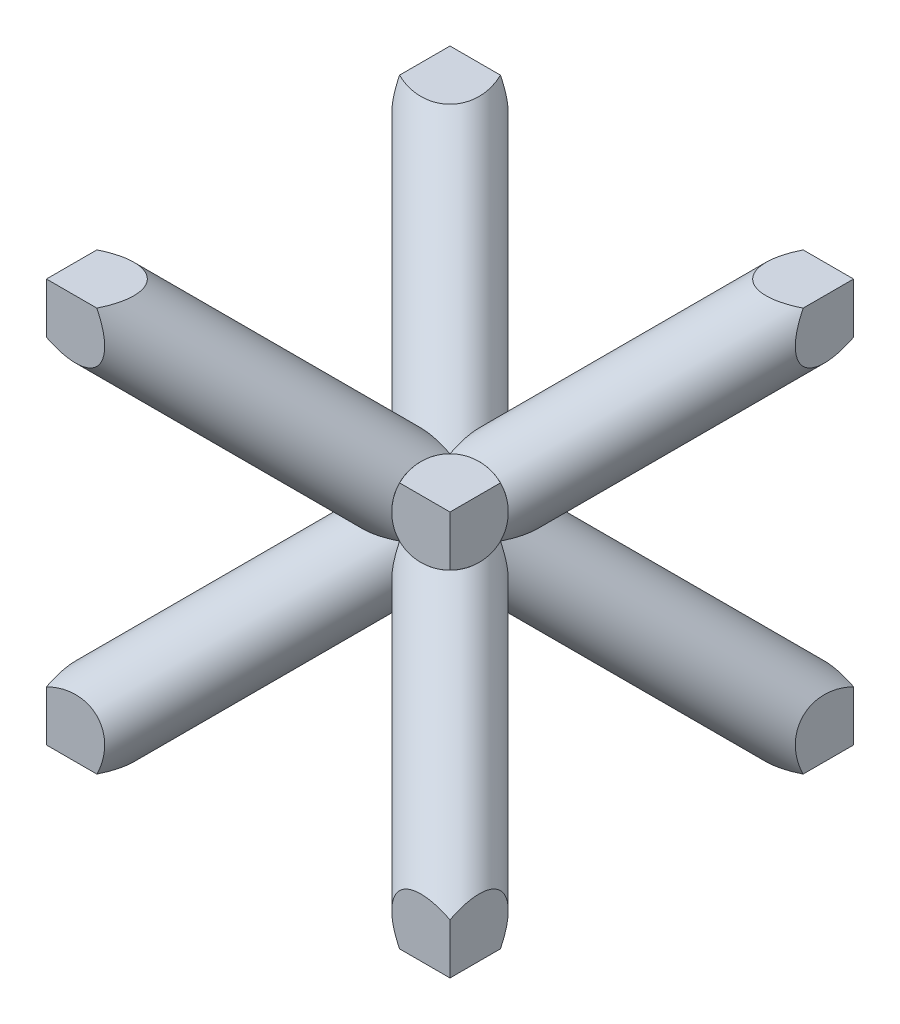
ISO-10303-21;
HEADER;
FILE_DESCRIPTION(('STEP AP214'),'2;1');
FILE_NAME('part.step','',(''),(''),'','','');
FILE_SCHEMA(('AUTOMOTIVE_DESIGN { 1 0 10303 214 1 1 1 1 }'));
ENDSEC;
DATA;
#1=APPLICATION_CONTEXT('core data for automotive mechanical design processes');
#2=APPLICATION_PROTOCOL_DEFINITION('international standard','automotive_design',2000,#1);
#3=PRODUCT_CONTEXT('',#1,'mechanical');
#4=PRODUCT('Part','Part','',(#3));
#5=PRODUCT_RELATED_PRODUCT_CATEGORY('part','',(#4));
#6=PRODUCT_DEFINITION_FORMATION('','',#4);
#7=PRODUCT_DEFINITION_CONTEXT('part definition',#1,'design');
#8=PRODUCT_DEFINITION('design','',#6,#7);
#9=PRODUCT_DEFINITION_SHAPE('','',#8);
#10=(LENGTH_UNIT() NAMED_UNIT(*) SI_UNIT(.MILLI.,.METRE.));
#11=(NAMED_UNIT(*) PLANE_ANGLE_UNIT() SI_UNIT($,.RADIAN.));
#12=(NAMED_UNIT(*) SI_UNIT($,.STERADIAN.) SOLID_ANGLE_UNIT());
#13=UNCERTAINTY_MEASURE_WITH_UNIT(LENGTH_MEASURE(1.E-05),#10,'distance_accuracy_value','');
#14=(GEOMETRIC_REPRESENTATION_CONTEXT(3) GLOBAL_UNCERTAINTY_ASSIGNED_CONTEXT((#13)) GLOBAL_UNIT_ASSIGNED_CONTEXT((#10,
#11,#12)) REPRESENTATION_CONTEXT('',''));
#15=CARTESIAN_POINT('',(0.,0.,0.));
#16=DIRECTION('',(0.,0.,1.));
#17=DIRECTION('',(1.,0.,0.));
#18=AXIS2_PLACEMENT_3D('',#15,#16,#17);
#19=CARTESIAN_POINT('',(4.35578821797053,0.644211782029457,-4.35578821797053));
#20=DIRECTION('',(-0.577350269189626,0.577350269189626,0.577350269189626));
#21=DIRECTION('',(-0.707106781186548,-0.707106781186547,0.));
#22=AXIS2_PLACEMENT_3D('',#19,#20,#21);
#23=CYLINDRICAL_SURFACE('',#22,0.816496580927726);
#24=CARTESIAN_POINT('',(0.,5.00000000000001,0.));
#25=DIRECTION('',(0.,1.,0.));
#26=DIRECTION('',(-0.707106781186548,0.,0.707106781186547));
#27=AXIS2_PLACEMENT_3D('',#24,#25,#26);
#28=ELLIPSE('',#27,1.41421356237308,0.816496580927718);
#29=CARTESIAN_POINT('',(0.999999999999989,4.99999999999999,0.));
#30=VERTEX_POINT('',#29);
#31=CARTESIAN_POINT('',(0.,5.,-1.));
#32=VERTEX_POINT('',#31);
#33=EDGE_CURVE('E548',#30,#32,#28,.T.);
#34=ORIENTED_EDGE('',*,*,#33,.F.);
#35=CARTESIAN_POINT('',(0.,5.,0.));
#36=DIRECTION('',(0.,0.,1.));
#37=DIRECTION('',(-0.707106781186547,0.707106781186548,0.));
#38=AXIS2_PLACEMENT_3D('',#35,#36,#37);
#39=ELLIPSE('',#38,1.4142135623731,0.816496580927727);
#40=CARTESIAN_POINT('',(0.,4.,0.));
#41=VERTEX_POINT('',#40);
#42=EDGE_CURVE('E530',#30,#41,#39,.F.);
#43=ORIENTED_EDGE('',*,*,#42,.T.);
#44=CARTESIAN_POINT('',(0.,5.,0.));
#45=DIRECTION('',(-1.,0.,0.));
#46=DIRECTION('',(0.,0.707106781186548,0.707106781186547));
#47=AXIS2_PLACEMENT_3D('',#44,#45,#46);
#48=ELLIPSE('',#47,1.4142135623731,0.816496580927727);
#49=EDGE_CURVE('E520',#41,#32,#48,.F.);
#50=ORIENTED_EDGE('',*,*,#49,.T.);
#51=EDGE_LOOP('',(#34,#43,#50));
#52=FACE_BOUND('',#51,.T.);
#53=CARTESIAN_POINT('',(3.99999999999999,0.999999999999998,-3.99999999999999));
#54=DIRECTION('',(0.,0.,-1.));
#55=DIRECTION('',(-0.707106781186547,0.707106781186548,0.));
#56=AXIS2_PLACEMENT_3D('',#53,#54,#55);
#57=ELLIPSE('',#56,1.41421356237309,0.816496580927726);
#58=CARTESIAN_POINT('',(3.99999999999999,1.99999999999999,-3.99999999999999));
#59=VERTEX_POINT('',#58);
#60=CARTESIAN_POINT('',(2.99999999999999,1.,-3.99999999999999));
#61=VERTEX_POINT('',#60);
#62=EDGE_CURVE('E260',#59,#61,#57,.F.);
#63=ORIENTED_EDGE('',*,*,#62,.T.);
#64=CARTESIAN_POINT('',(3.99999999999999,1.,-3.99999999999999));
#65=DIRECTION('',(0.,-1.,0.));
#66=DIRECTION('',(-0.707106781186548,0.,0.707106781186547));
#67=AXIS2_PLACEMENT_3D('',#64,#65,#66);
#68=ELLIPSE('',#67,1.41421356237309,0.816496580927726);
#69=CARTESIAN_POINT('',(3.99999999999999,1.,-2.99999999999999));
#70=VERTEX_POINT('',#69);
#71=EDGE_CURVE('E269',#70,#61,#68,.T.);
#72=ORIENTED_EDGE('',*,*,#71,.F.);
#73=CARTESIAN_POINT('',(4.,0.99999999999999,-4.));
#74=DIRECTION('',(1.,0.,0.));
#75=DIRECTION('',(0.,0.707106781186548,0.707106781186547));
#76=AXIS2_PLACEMENT_3D('',#73,#74,#75);
#77=ELLIPSE('',#76,1.4142135623731,0.816496580927726);
#78=EDGE_CURVE('E273',#59,#70,#77,.T.);
#79=ORIENTED_EDGE('',*,*,#78,.F.);
#80=EDGE_LOOP('',(#63,#72,#79));
#81=FACE_BOUND('',#80,.T.);
#82=ADVANCED_FACE('F120',(#52,#81),#23,.T.);
#83=CARTESIAN_POINT('',(-4.32692070451106,0.673079295488972,4.32692070451106));
#84=DIRECTION('',(0.577350269189626,0.577350269189625,-0.577350269189626));
#85=DIRECTION('',(-0.707106781186547,0.,-0.707106781186547));
#86=AXIS2_PLACEMENT_3D('',#83,#84,#85);
#87=CYLINDRICAL_SURFACE('',#86,0.816496580927711);
#88=CARTESIAN_POINT('',(0.,5.00000000000002,0.));
#89=DIRECTION('',(0.,0.,-1.));
#90=DIRECTION('',(-0.707106781186548,-0.707106781186547,0.));
#91=AXIS2_PLACEMENT_3D('',#88,#89,#90);
#92=ELLIPSE('',#91,1.41421356237308,0.816496580927719);
#93=CARTESIAN_POINT('',(0.,6.,0.));
#94=VERTEX_POINT('',#93);
#95=EDGE_CURVE('E309',#30,#94,#92,.F.);
#96=ORIENTED_EDGE('',*,*,#95,.F.);
#97=ORIENTED_EDGE('',*,*,#33,.T.);
#98=CARTESIAN_POINT('',(0.,5.00000000000001,0.));
#99=DIRECTION('',(1.,0.,0.));
#100=DIRECTION('',(0.,-0.707106781186547,0.707106781186548));
#101=AXIS2_PLACEMENT_3D('',#98,#99,#100);
#102=ELLIPSE('',#101,1.41421356237308,0.816496580927719);
#103=EDGE_CURVE('E347',#94,#32,#102,.F.);
#104=ORIENTED_EDGE('',*,*,#103,.F.);
#105=EDGE_LOOP('',(#96,#97,#104));
#106=FACE_BOUND('',#105,.T.);
#107=CARTESIAN_POINT('',(3.99999999999998,9.,-3.99999999999998));
#108=DIRECTION('',(0.,1.,0.));
#109=DIRECTION('',(0.707106781186548,0.,-0.707106781186548));
#110=AXIS2_PLACEMENT_3D('',#107,#108,#109);
#111=ELLIPSE('',#110,1.41421356237307,0.816496580927711);
#112=CARTESIAN_POINT('',(3.00000000000001,9.,-4.));
#113=VERTEX_POINT('',#112);
#114=CARTESIAN_POINT('',(3.99999999999999,8.99999999999999,-3.00000000000001));
#115=VERTEX_POINT('',#114);
#116=EDGE_CURVE('E119',#113,#115,#111,.T.);
#117=ORIENTED_EDGE('',*,*,#116,.F.);
#118=CARTESIAN_POINT('',(4.,9.00000000000002,-4.));
#119=DIRECTION('',(0.,0.,-1.));
#120=DIRECTION('',(0.707106781186548,0.707106781186548,0.));
#121=AXIS2_PLACEMENT_3D('',#118,#119,#120);
#122=ELLIPSE('',#121,1.41421356237307,0.816496580927711);
#123=CARTESIAN_POINT('',(3.99999999999999,8.00000000000004,-4.));
#124=VERTEX_POINT('',#123);
#125=EDGE_CURVE('E144',#113,#124,#122,.F.);
#126=ORIENTED_EDGE('',*,*,#125,.T.);
#127=CARTESIAN_POINT('',(4.,9.00000000000002,-4.));
#128=DIRECTION('',(1.,0.,0.));
#129=DIRECTION('',(0.,0.707106781186547,-0.707106781186548));
#130=AXIS2_PLACEMENT_3D('',#127,#128,#129);
#131=ELLIPSE('',#130,1.41421356237307,0.816496580927711);
#132=EDGE_CURVE('E507',#115,#124,#131,.T.);
#133=ORIENTED_EDGE('',*,*,#132,.F.);
#134=EDGE_LOOP('',(#117,#126,#133));
#135=FACE_BOUND('',#134,.T.);
#136=ADVANCED_FACE('F469',(#106,#135),#87,.T.);
#137=CARTESIAN_POINT('',(-5.00010307764064,9.,0.));
#138=DIRECTION('',(0.,-1.,0.));
#139=DIRECTION('',(0.,0.,-1.));
#140=AXIS2_PLACEMENT_3D('',#137,#138,#139);
#141=PLANE('',#140);
#142=DIRECTION('',(1.,0.,0.));
#143=VECTOR('',#142,1.);
#144=CARTESIAN_POINT('',(2.84529946162075,9.,-4.));
#145=LINE('',#144,#143);
#146=CARTESIAN_POINT('',(3.99999999999999,9.,-4.));
#147=VERTEX_POINT('',#146);
#148=EDGE_CURVE('E275',#113,#147,#145,.T.);
#149=ORIENTED_EDGE('',*,*,#148,.F.);
#150=ORIENTED_EDGE('',*,*,#116,.T.);
#151=DIRECTION('',(0.,0.,1.));
#152=VECTOR('',#151,1.);
#153=CARTESIAN_POINT('',(3.99999999999999,8.99999999999999,-5.02196380801708));
#154=LINE('',#153,#152);
#155=EDGE_CURVE('E318',#147,#115,#154,.T.);
#156=ORIENTED_EDGE('',*,*,#155,.F.);
#157=EDGE_LOOP('',(#149,#150,#156));
#158=FACE_BOUND('',#157,.T.);
#159=ADVANCED_FACE('F464',(#158),#141,.F.);
#160=CARTESIAN_POINT('',(-5.00010307764064,1.,0.));
#161=DIRECTION('',(0.,1.,0.));
#162=DIRECTION('',(0.,0.,1.));
#163=AXIS2_PLACEMENT_3D('',#160,#161,#162);
#164=PLANE('',#163);
#165=DIRECTION('',(-1.,0.,0.));
#166=VECTOR('',#165,1.);
#167=CARTESIAN_POINT('',(-3.99999999999999,0.999999999999996,-4.));
#168=LINE('',#167,#166);
#169=CARTESIAN_POINT('',(-3.,0.999999999999996,-4.));
#170=VERTEX_POINT('',#169);
#171=CARTESIAN_POINT('',(-3.99999999999999,0.999999999999996,-4.));
#172=VERTEX_POINT('',#171);
#173=EDGE_CURVE('E395',#170,#172,#168,.T.);
#174=ORIENTED_EDGE('',*,*,#173,.F.);
#175=CARTESIAN_POINT('',(-4.00000000000001,0.999999999999999,-4.00000000000001));
#176=DIRECTION('',(0.,1.,0.));
#177=DIRECTION('',(-0.707106781186548,0.,-0.707106781186548));
#178=AXIS2_PLACEMENT_3D('',#175,#176,#177);
#179=ELLIPSE('',#178,1.4142135623731,0.816496580927728);
#180=CARTESIAN_POINT('',(-4.,1.,-3.));
#181=VERTEX_POINT('',#180);
#182=EDGE_CURVE('E292',#170,#181,#179,.F.);
#183=ORIENTED_EDGE('',*,*,#182,.T.);
#184=DIRECTION('',(0.,0.,1.));
#185=VECTOR('',#184,1.);
#186=CARTESIAN_POINT('',(-4.,1.,-5.02196380801708));
#187=LINE('',#186,#185);
#188=EDGE_CURVE('E324',#172,#181,#187,.T.);
#189=ORIENTED_EDGE('',*,*,#188,.F.);
#190=EDGE_LOOP('',(#174,#183,#189));
#191=FACE_BOUND('',#190,.T.);
#192=ADVANCED_FACE('F569',(#191),#164,.F.);
#193=DIRECTION('',(-1.,0.,0.));
#194=VECTOR('',#193,1.);
#195=CARTESIAN_POINT('',(3.99999999999999,1.,-3.99999999999999));
#196=LINE('',#195,#194);
#197=CARTESIAN_POINT('',(3.99999999999999,1.,-3.99999999999999));
#198=VERTEX_POINT('',#197);
#199=EDGE_CURVE('E257',#198,#61,#196,.T.);
#200=ORIENTED_EDGE('',*,*,#199,.F.);
#201=DIRECTION('',(0.,0.,1.));
#202=VECTOR('',#201,1.);
#203=CARTESIAN_POINT('',(3.99999999999999,1.,-5.02196380801708));
#204=LINE('',#203,#202);
#205=EDGE_CURVE('E267',#198,#70,#204,.T.);
#206=ORIENTED_EDGE('',*,*,#205,.T.);
#207=ORIENTED_EDGE('',*,*,#71,.T.);
#208=EDGE_LOOP('',(#200,#206,#207));
#209=FACE_BOUND('',#208,.T.);
#210=ADVANCED_FACE('F270',(#209),#164,.F.);
#211=DIRECTION('',(1.,0.,0.));
#212=VECTOR('',#211,1.);
#213=CARTESIAN_POINT('',(-2.84529946162076,9.,-4.00000000000001));
#214=LINE('',#213,#212);
#215=CARTESIAN_POINT('',(-4.,8.99999999999999,-4.00000000000001));
#216=VERTEX_POINT('',#215);
#217=CARTESIAN_POINT('',(-3.,9.,-4.00000000000001));
#218=VERTEX_POINT('',#217);
#219=EDGE_CURVE('E388',#216,#218,#214,.T.);
#220=ORIENTED_EDGE('',*,*,#219,.F.);
#221=DIRECTION('',(0.,0.,1.));
#222=VECTOR('',#221,1.);
#223=CARTESIAN_POINT('',(-4.,9.,-5.02196380801708));
#224=LINE('',#223,#222);
#225=CARTESIAN_POINT('',(-4.,9.,-3.));
#226=VERTEX_POINT('',#225);
#227=EDGE_CURVE('E307',#216,#226,#224,.T.);
#228=ORIENTED_EDGE('',*,*,#227,.T.);
#229=CARTESIAN_POINT('',(-4.,9.,-4.));
#230=DIRECTION('',(0.,-1.,0.));
#231=DIRECTION('',(0.707106781186548,0.,0.707106781186548));
#232=AXIS2_PLACEMENT_3D('',#229,#230,#231);
#233=ELLIPSE('',#232,1.4142135623731,0.816496580927728);
#234=EDGE_CURVE('E366',#226,#218,#233,.F.);
#235=ORIENTED_EDGE('',*,*,#234,.T.);
#236=EDGE_LOOP('',(#220,#228,#235));
#237=FACE_BOUND('',#236,.T.);
#238=ADVANCED_FACE('F394',(#237),#141,.F.);
#239=CARTESIAN_POINT('',(3.99999999999999,1.,-5.02196380801708));
#240=DIRECTION('',(-1.,0.,0.));
#241=DIRECTION('',(0.,0.,1.));
#242=AXIS2_PLACEMENT_3D('',#239,#240,#241);
#243=PLANE('',#242);
#244=DIRECTION('',(0.,-1.,0.));
#245=VECTOR('',#244,1.);
#246=CARTESIAN_POINT('',(3.99999999999999,9.,-4.));
#247=LINE('',#246,#245);
#248=EDGE_CURVE('E254',#59,#198,#247,.T.);
#249=ORIENTED_EDGE('',*,*,#248,.F.);
#250=ORIENTED_EDGE('',*,*,#78,.T.);
#251=ORIENTED_EDGE('',*,*,#205,.F.);
#252=EDGE_LOOP('',(#249,#250,#251));
#253=FACE_BOUND('',#252,.T.);
#254=ADVANCED_FACE('F274',(#253),#243,.F.);
#255=CARTESIAN_POINT('',(-4.,9.,-5.02196380801708));
#256=DIRECTION('',(1.,0.,0.));
#257=DIRECTION('',(0.,1.,0.));
#258=AXIS2_PLACEMENT_3D('',#255,#256,#257);
#259=PLANE('',#258);
#260=DIRECTION('',(0.,1.,0.));
#261=VECTOR('',#260,1.);
#262=CARTESIAN_POINT('',(-4.,8.99999999999999,-4.00000000000001));
#263=LINE('',#262,#261);
#264=CARTESIAN_POINT('',(-4.,2.00000000000001,-4.));
#265=VERTEX_POINT('',#264);
#266=EDGE_CURVE('E126',#172,#265,#263,.T.);
#267=ORIENTED_EDGE('',*,*,#266,.F.);
#268=ORIENTED_EDGE('',*,*,#188,.T.);
#269=CARTESIAN_POINT('',(-4.,1.00000000000001,-4.));
#270=DIRECTION('',(-1.,0.,0.));
#271=DIRECTION('',(0.,-0.707106781186547,-0.707106781186548));
#272=AXIS2_PLACEMENT_3D('',#269,#270,#271);
#273=ELLIPSE('',#272,1.4142135623731,0.816496580927728);
#274=EDGE_CURVE('E323',#265,#181,#273,.F.);
#275=ORIENTED_EDGE('',*,*,#274,.F.);
#276=EDGE_LOOP('',(#267,#268,#275));
#277=FACE_BOUND('',#276,.T.);
#278=ADVANCED_FACE('F573',(#277),#259,.F.);
#279=CARTESIAN_POINT('',(-4.,8.,-4.00000000000001));
#280=VERTEX_POINT('',#279);
#281=EDGE_CURVE('E13',#280,#216,#263,.T.);
#282=ORIENTED_EDGE('',*,*,#281,.F.);
#283=CARTESIAN_POINT('',(-4.,9.,-4.));
#284=DIRECTION('',(-1.,0.,0.));
#285=DIRECTION('',(0.,-0.707106781186547,0.707106781186548));
#286=AXIS2_PLACEMENT_3D('',#283,#284,#285);
#287=ELLIPSE('',#286,1.4142135623731,0.816496580927728);
#288=EDGE_CURVE('E330',#226,#280,#287,.F.);
#289=ORIENTED_EDGE('',*,*,#288,.F.);
#290=ORIENTED_EDGE('',*,*,#227,.F.);
#291=EDGE_LOOP('',(#282,#289,#290));
#292=FACE_BOUND('',#291,.T.);
#293=ADVANCED_FACE('F389',(#292),#259,.F.);
#294=EDGE_CURVE('E263',#147,#124,#247,.T.);
#295=ORIENTED_EDGE('',*,*,#294,.F.);
#296=ORIENTED_EDGE('',*,*,#155,.T.);
#297=ORIENTED_EDGE('',*,*,#132,.T.);
#298=EDGE_LOOP('',(#295,#296,#297));
#299=FACE_BOUND('',#298,.T.);
#300=ADVANCED_FACE('F597',(#299),#243,.F.);
#301=CARTESIAN_POINT('',(4.32692070451105,9.32692070451106,4.32692070451105));
#302=DIRECTION('',(-0.577350269189626,-0.577350269189626,-0.577350269189626));
#303=DIRECTION('',(-0.707106781186548,0.,0.707106781186548));
#304=AXIS2_PLACEMENT_3D('',#301,#302,#303);
#305=CYLINDRICAL_SURFACE('',#304,0.816496580927728);
#306=CARTESIAN_POINT('',(0.,5.,0.));
#307=DIRECTION('',(0.,-1.,0.));
#308=DIRECTION('',(-0.707106781186548,0.,-0.707106781186548));
#309=AXIS2_PLACEMENT_3D('',#306,#307,#308);
#310=ELLIPSE('',#309,1.4142135623731,0.816496580927728);
#311=CARTESIAN_POINT('',(0.,5.,0.999999999999999));
#312=VERTEX_POINT('',#311);
#313=EDGE_CURVE('E513',#30,#312,#310,.T.);
#314=ORIENTED_EDGE('',*,*,#313,.F.);
#315=ORIENTED_EDGE('',*,*,#95,.T.);
#316=CARTESIAN_POINT('',(0.,5.,0.));
#317=DIRECTION('',(-1.,0.,0.));
#318=DIRECTION('',(0.,0.707106781186548,0.707106781186547));
#319=AXIS2_PLACEMENT_3D('',#316,#317,#318);
#320=ELLIPSE('',#319,1.4142135623731,0.816496580927727);
#321=EDGE_CURVE('E505',#312,#94,#320,.T.);
#322=ORIENTED_EDGE('',*,*,#321,.F.);
#323=EDGE_LOOP('',(#314,#315,#322));
#324=FACE_BOUND('',#323,.T.);
#325=CARTESIAN_POINT('',(4.,9.,4.));
#326=DIRECTION('',(0.,0.,1.));
#327=DIRECTION('',(-0.707106781186548,-0.707106781186547,0.));
#328=AXIS2_PLACEMENT_3D('',#325,#326,#327);
#329=ELLIPSE('',#328,1.4142135623731,0.816496580927728);
#330=CARTESIAN_POINT('',(3.,9.,4.));
#331=VERTEX_POINT('',#330);
#332=CARTESIAN_POINT('',(4.,8.,4.));
#333=VERTEX_POINT('',#332);
#334=EDGE_CURVE('E302',#331,#333,#329,.T.);
#335=ORIENTED_EDGE('',*,*,#334,.F.);
#336=CARTESIAN_POINT('',(4.,9.,4.));
#337=DIRECTION('',(0.,-1.,0.));
#338=DIRECTION('',(-0.707106781186548,0.,-0.707106781186548));
#339=AXIS2_PLACEMENT_3D('',#336,#337,#338);
#340=ELLIPSE('',#339,1.4142135623731,0.816496580927728);
#341=CARTESIAN_POINT('',(3.99999999999999,8.99999999999999,2.99999999999999));
#342=VERTEX_POINT('',#341);
#343=EDGE_CURVE('E336',#342,#331,#340,.F.);
#344=ORIENTED_EDGE('',*,*,#343,.F.);
#345=CARTESIAN_POINT('',(4.,9.,4.));
#346=DIRECTION('',(1.,0.,0.));
#347=DIRECTION('',(0.,-0.707106781186547,-0.707106781186548));
#348=AXIS2_PLACEMENT_3D('',#345,#346,#347);
#349=ELLIPSE('',#348,1.4142135623731,0.816496580927728);
#350=EDGE_CURVE('E333',#342,#333,#349,.F.);
#351=ORIENTED_EDGE('',*,*,#350,.T.);
#352=EDGE_LOOP('',(#335,#344,#351));
#353=FACE_BOUND('',#352,.T.);
#354=ADVANCED_FACE('F446',(#324,#353),#305,.T.);
#355=CARTESIAN_POINT('',(-4.32692070451105,9.32692070451106,-4.32692070451105));
#356=DIRECTION('',(0.577350269189626,-0.577350269189626,0.577350269189626));
#357=DIRECTION('',(0.707106781186548,0.,-0.707106781186548));
#358=AXIS2_PLACEMENT_3D('',#355,#356,#357);
#359=CYLINDRICAL_SURFACE('',#358,0.816496580927728);
#360=ORIENTED_EDGE('',*,*,#313,.T.);
#361=CARTESIAN_POINT('',(0.,5.00000000000001,0.));
#362=DIRECTION('',(1.,0.,0.));
#363=DIRECTION('',(0.,-0.707106781186547,0.707106781186548));
#364=AXIS2_PLACEMENT_3D('',#361,#362,#363);
#365=ELLIPSE('',#364,1.41421356237308,0.816496580927719);
#366=EDGE_CURVE('E523',#312,#41,#365,.T.);
#367=ORIENTED_EDGE('',*,*,#366,.T.);
#368=ORIENTED_EDGE('',*,*,#42,.F.);
#369=EDGE_LOOP('',(#360,#367,#368));
#370=FACE_BOUND('',#369,.T.);
#371=CARTESIAN_POINT('',(4.,1.00000000000001,4.));
#372=DIRECTION('',(0.,0.,1.));
#373=DIRECTION('',(0.707106781186548,-0.707106781186547,0.));
#374=AXIS2_PLACEMENT_3D('',#371,#372,#373);
#375=ELLIPSE('',#374,1.4142135623731,0.816496580927728);
#376=CARTESIAN_POINT('',(4.,2.00000000000001,4.));
#377=VERTEX_POINT('',#376);
#378=CARTESIAN_POINT('',(3.,1.,4.));
#379=VERTEX_POINT('',#378);
#380=EDGE_CURVE('E433',#377,#379,#375,.T.);
#381=ORIENTED_EDGE('',*,*,#380,.F.);
#382=CARTESIAN_POINT('',(4.,1.00000000000001,4.));
#383=DIRECTION('',(1.,0.,0.));
#384=DIRECTION('',(0.,-0.707106781186547,0.707106781186548));
#385=AXIS2_PLACEMENT_3D('',#382,#383,#384);
#386=ELLIPSE('',#385,1.4142135623731,0.816496580927728);
#387=CARTESIAN_POINT('',(4.,1.,3.));
#388=VERTEX_POINT('',#387);
#389=EDGE_CURVE('E355',#377,#388,#386,.F.);
#390=ORIENTED_EDGE('',*,*,#389,.T.);
#391=CARTESIAN_POINT('',(4.00000000000001,0.999999999999999,4.00000000000001));
#392=DIRECTION('',(0.,1.,0.));
#393=DIRECTION('',(0.707106781186548,0.,0.707106781186548));
#394=AXIS2_PLACEMENT_3D('',#391,#392,#393);
#395=ELLIPSE('',#394,1.4142135623731,0.816496580927728);
#396=EDGE_CURVE('E357',#379,#388,#395,.F.);
#397=ORIENTED_EDGE('',*,*,#396,.F.);
#398=EDGE_LOOP('',(#381,#390,#397));
#399=FACE_BOUND('',#398,.T.);
#400=ADVANCED_FACE('F521',(#370,#399),#359,.T.);
#401=DIRECTION('',(1.,0.,0.));
#402=VECTOR('',#401,1.);
#403=CARTESIAN_POINT('',(2.8452994616208,1.,4.));
#404=LINE('',#403,#402);
#405=CARTESIAN_POINT('',(4.,1.,4.));
#406=VERTEX_POINT('',#405);
#407=EDGE_CURVE('E415',#379,#406,#404,.T.);
#408=ORIENTED_EDGE('',*,*,#407,.F.);
#409=ORIENTED_EDGE('',*,*,#396,.T.);
#410=EDGE_CURVE('E280',#388,#406,#204,.T.);
#411=ORIENTED_EDGE('',*,*,#410,.T.);
#412=EDGE_LOOP('',(#408,#409,#411));
#413=FACE_BOUND('',#412,.T.);
#414=ADVANCED_FACE('F462',(#413),#164,.F.);
#415=DIRECTION('',(-1.,0.,0.));
#416=VECTOR('',#415,1.);
#417=CARTESIAN_POINT('',(-4.,9.,4.));
#418=LINE('',#417,#416);
#419=CARTESIAN_POINT('',(-3.,9.,4.));
#420=VERTEX_POINT('',#419);
#421=CARTESIAN_POINT('',(-4.,9.,4.));
#422=VERTEX_POINT('',#421);
#423=EDGE_CURVE('E420',#420,#422,#418,.T.);
#424=ORIENTED_EDGE('',*,*,#423,.F.);
#425=CARTESIAN_POINT('',(-4.,9.,4.));
#426=DIRECTION('',(0.,1.,0.));
#427=DIRECTION('',(-0.707106781186548,0.,0.707106781186547));
#428=AXIS2_PLACEMENT_3D('',#425,#426,#427);
#429=ELLIPSE('',#428,1.41421356237309,0.816496580927726);
#430=CARTESIAN_POINT('',(-4.,9.,3.));
#431=VERTEX_POINT('',#430);
#432=EDGE_CURVE('E360',#420,#431,#429,.T.);
#433=ORIENTED_EDGE('',*,*,#432,.T.);
#434=EDGE_CURVE('E285',#431,#422,#224,.T.);
#435=ORIENTED_EDGE('',*,*,#434,.T.);
#436=EDGE_LOOP('',(#424,#433,#435));
#437=FACE_BOUND('',#436,.T.);
#438=ADVANCED_FACE('F451',(#437),#141,.F.);
#439=DIRECTION('',(-1.,0.,0.));
#440=VECTOR('',#439,1.);
#441=CARTESIAN_POINT('',(4.,9.,4.));
#442=LINE('',#441,#440);
#443=CARTESIAN_POINT('',(4.,9.,4.));
#444=VERTEX_POINT('',#443);
#445=EDGE_CURVE('E410',#444,#331,#442,.T.);
#446=ORIENTED_EDGE('',*,*,#445,.F.);
#447=EDGE_CURVE('E286',#342,#444,#154,.T.);
#448=ORIENTED_EDGE('',*,*,#447,.F.);
#449=ORIENTED_EDGE('',*,*,#343,.T.);
#450=EDGE_LOOP('',(#446,#448,#449));
#451=FACE_BOUND('',#450,.T.);
#452=ADVANCED_FACE('F452',(#451),#141,.F.);
#453=DIRECTION('',(1.,0.,0.));
#454=VECTOR('',#453,1.);
#455=CARTESIAN_POINT('',(-2.8452994616208,1.,4.));
#456=LINE('',#455,#454);
#457=CARTESIAN_POINT('',(-4.,1.,4.));
#458=VERTEX_POINT('',#457);
#459=CARTESIAN_POINT('',(-3.00000000000003,1.,4.));
#460=VERTEX_POINT('',#459);
#461=EDGE_CURVE('E411',#458,#460,#456,.T.);
#462=ORIENTED_EDGE('',*,*,#461,.F.);
#463=CARTESIAN_POINT('',(-4.,1.,3.00000000000003));
#464=VERTEX_POINT('',#463);
#465=EDGE_CURVE('E279',#464,#458,#187,.T.);
#466=ORIENTED_EDGE('',*,*,#465,.F.);
#467=CARTESIAN_POINT('',(-4.00000000000003,1.,4.00000000000003));
#468=DIRECTION('',(0.,1.,0.));
#469=DIRECTION('',(0.707106781186548,0.,-0.707106781186548));
#470=AXIS2_PLACEMENT_3D('',#467,#468,#469);
#471=ELLIPSE('',#470,1.41421356237307,0.816496580927711);
#472=EDGE_CURVE('E532',#460,#464,#471,.T.);
#473=ORIENTED_EDGE('',*,*,#472,.F.);
#474=EDGE_LOOP('',(#462,#466,#473));
#475=FACE_BOUND('',#474,.T.);
#476=ADVANCED_FACE('F455',(#475),#164,.F.);
#477=DIRECTION('',(0.,-1.,0.));
#478=VECTOR('',#477,1.);
#479=CARTESIAN_POINT('',(-4.,1.,4.));
#480=LINE('',#479,#478);
#481=CARTESIAN_POINT('',(-4.,8.,4.));
#482=VERTEX_POINT('',#481);
#483=EDGE_CURVE('E406',#422,#482,#480,.T.);
#484=ORIENTED_EDGE('',*,*,#483,.F.);
#485=ORIENTED_EDGE('',*,*,#434,.F.);
#486=CARTESIAN_POINT('',(-4.,9.,4.));
#487=DIRECTION('',(-1.,0.,0.));
#488=DIRECTION('',(0.,0.707106781186548,0.707106781186547));
#489=AXIS2_PLACEMENT_3D('',#486,#487,#488);
#490=ELLIPSE('',#489,1.4142135623731,0.816496580927726);
#491=EDGE_CURVE('E341',#431,#482,#490,.T.);
#492=ORIENTED_EDGE('',*,*,#491,.T.);
#493=EDGE_LOOP('',(#484,#485,#492));
#494=FACE_BOUND('',#493,.T.);
#495=ADVANCED_FACE('F457',(#494),#259,.F.);
#496=DIRECTION('',(0.,1.,0.));
#497=VECTOR('',#496,1.);
#498=CARTESIAN_POINT('',(4.,1.,4.));
#499=LINE('',#498,#497);
#500=EDGE_CURVE('E421',#333,#444,#499,.T.);
#501=ORIENTED_EDGE('',*,*,#500,.F.);
#502=ORIENTED_EDGE('',*,*,#350,.F.);
#503=ORIENTED_EDGE('',*,*,#447,.T.);
#504=EDGE_LOOP('',(#501,#502,#503));
#505=FACE_BOUND('',#504,.T.);
#506=ADVANCED_FACE('F447',(#505),#243,.F.);
#507=EDGE_CURVE('E425',#406,#377,#499,.T.);
#508=ORIENTED_EDGE('',*,*,#507,.F.);
#509=ORIENTED_EDGE('',*,*,#410,.F.);
#510=ORIENTED_EDGE('',*,*,#389,.F.);
#511=EDGE_LOOP('',(#508,#509,#510));
#512=FACE_BOUND('',#511,.T.);
#513=ADVANCED_FACE('F600',(#512),#243,.F.);
#514=CARTESIAN_POINT('',(-4.,2.00000000000001,4.));
#515=VERTEX_POINT('',#514);
#516=EDGE_CURVE('E129',#515,#458,#480,.T.);
#517=ORIENTED_EDGE('',*,*,#516,.F.);
#518=CARTESIAN_POINT('',(-4.,1.00000000000003,4.));
#519=DIRECTION('',(-1.,0.,0.));
#520=DIRECTION('',(0.,0.707106781186547,-0.707106781186548));
#521=AXIS2_PLACEMENT_3D('',#518,#519,#520);
#522=ELLIPSE('',#521,1.41421356237307,0.816496580927711);
#523=EDGE_CURVE('E537',#515,#464,#522,.T.);
#524=ORIENTED_EDGE('',*,*,#523,.T.);
#525=ORIENTED_EDGE('',*,*,#465,.T.);
#526=EDGE_LOOP('',(#517,#524,#525));
#527=FACE_BOUND('',#526,.T.);
#528=ADVANCED_FACE('F489',(#527),#259,.F.);
#529=ORIENTED_EDGE('',*,*,#49,.F.);
#530=CARTESIAN_POINT('',(0.,5.00000000000002,0.));
#531=DIRECTION('',(0.,0.,-1.));
#532=DIRECTION('',(-0.707106781186548,-0.707106781186547,0.));
#533=AXIS2_PLACEMENT_3D('',#530,#531,#532);
#534=ELLIPSE('',#533,1.41421356237308,0.816496580927719);
#535=CARTESIAN_POINT('',(-0.999999999999997,5.,0.));
#536=VERTEX_POINT('',#535);
#537=EDGE_CURVE('E508',#41,#536,#534,.T.);
#538=ORIENTED_EDGE('',*,*,#537,.T.);
#539=CARTESIAN_POINT('',(0.,5.,0.));
#540=DIRECTION('',(0.,-1.,0.));
#541=DIRECTION('',(-0.707106781186548,0.,-0.707106781186548));
#542=AXIS2_PLACEMENT_3D('',#539,#540,#541);
#543=ELLIPSE('',#542,1.4142135623731,0.816496580927728);
#544=EDGE_CURVE('E554',#32,#536,#543,.F.);
#545=ORIENTED_EDGE('',*,*,#544,.F.);
#546=EDGE_LOOP('',(#529,#538,#545));
#547=FACE_BOUND('',#546,.T.);
#548=ORIENTED_EDGE('',*,*,#182,.F.);
#549=CARTESIAN_POINT('',(-4.,1.00000000000001,-4.));
#550=DIRECTION('',(0.,0.,1.));
#551=DIRECTION('',(-0.707106781186549,-0.707106781186546,0.));
#552=AXIS2_PLACEMENT_3D('',#549,#550,#551);
#553=ELLIPSE('',#552,1.4142135623731,0.816496580927728);
#554=EDGE_CURVE('E136',#170,#265,#553,.T.);
#555=ORIENTED_EDGE('',*,*,#554,.T.);
#556=ORIENTED_EDGE('',*,*,#274,.T.);
#557=EDGE_LOOP('',(#548,#555,#556));
#558=FACE_BOUND('',#557,.T.);
#559=ADVANCED_FACE('F485',(#547,#558),#305,.T.);
#560=CARTESIAN_POINT('',(-4.,9.,4.));
#561=DIRECTION('',(0.,0.,-1.));
#562=DIRECTION('',(-0.707106781186547,0.707106781186548,0.));
#563=AXIS2_PLACEMENT_3D('',#560,#561,#562);
#564=ELLIPSE('',#563,1.4142135623731,0.816496580927726);
#565=EDGE_CURVE('E431',#482,#420,#564,.F.);
#566=ORIENTED_EDGE('',*,*,#565,.F.);
#567=ORIENTED_EDGE('',*,*,#491,.F.);
#568=ORIENTED_EDGE('',*,*,#432,.F.);
#569=EDGE_LOOP('',(#566,#567,#568));
#570=FACE_BOUND('',#569,.T.);
#571=CARTESIAN_POINT('',(0.,5.00000000000001,0.));
#572=DIRECTION('',(0.,1.,0.));
#573=DIRECTION('',(-0.707106781186548,0.,0.707106781186547));
#574=AXIS2_PLACEMENT_3D('',#571,#572,#573);
#575=ELLIPSE('',#574,1.41421356237308,0.816496580927718);
#576=EDGE_CURVE('E499',#312,#536,#575,.F.);
#577=ORIENTED_EDGE('',*,*,#576,.F.);
#578=ORIENTED_EDGE('',*,*,#321,.T.);
#579=CARTESIAN_POINT('',(0.,5.,0.));
#580=DIRECTION('',(0.,0.,1.));
#581=DIRECTION('',(-0.707106781186547,0.707106781186548,0.));
#582=AXIS2_PLACEMENT_3D('',#579,#580,#581);
#583=ELLIPSE('',#582,1.4142135623731,0.816496580927727);
#584=EDGE_CURVE('E356',#94,#536,#583,.T.);
#585=ORIENTED_EDGE('',*,*,#584,.T.);
#586=EDGE_LOOP('',(#577,#578,#585));
#587=FACE_BOUND('',#586,.T.);
#588=ADVANCED_FACE('F472',(#570,#587),#23,.T.);
#589=CARTESIAN_POINT('',(-4.,1.00000000000003,4.));
#590=DIRECTION('',(0.,0.,-1.));
#591=DIRECTION('',(0.707106781186548,0.707106781186547,0.));
#592=AXIS2_PLACEMENT_3D('',#589,#590,#591);
#593=ELLIPSE('',#592,1.41421356237307,0.816496580927711);
#594=EDGE_CURVE('E419',#460,#515,#593,.F.);
#595=ORIENTED_EDGE('',*,*,#594,.F.);
#596=ORIENTED_EDGE('',*,*,#472,.T.);
#597=ORIENTED_EDGE('',*,*,#523,.F.);
#598=EDGE_LOOP('',(#595,#596,#597));
#599=FACE_BOUND('',#598,.T.);
#600=ORIENTED_EDGE('',*,*,#366,.F.);
#601=ORIENTED_EDGE('',*,*,#576,.T.);
#602=ORIENTED_EDGE('',*,*,#537,.F.);
#603=EDGE_LOOP('',(#600,#601,#602));
#604=FACE_BOUND('',#603,.T.);
#605=ADVANCED_FACE('F480',(#599,#604),#87,.T.);
#606=CARTESIAN_POINT('',(-4.00000000000001,9.00000000000001,-4.00000000000001));
#607=DIRECTION('',(0.,0.,1.));
#608=DIRECTION('',(0.707106781186548,-0.707106781186547,0.));
#609=AXIS2_PLACEMENT_3D('',#606,#607,#608);
#610=ELLIPSE('',#609,1.4142135623731,0.816496580927728);
#611=EDGE_CURVE('E385',#280,#218,#610,.T.);
#612=ORIENTED_EDGE('',*,*,#611,.T.);
#613=ORIENTED_EDGE('',*,*,#234,.F.);
#614=ORIENTED_EDGE('',*,*,#288,.T.);
#615=EDGE_LOOP('',(#612,#613,#614));
#616=FACE_BOUND('',#615,.T.);
#617=ORIENTED_EDGE('',*,*,#584,.F.);
#618=ORIENTED_EDGE('',*,*,#103,.T.);
#619=ORIENTED_EDGE('',*,*,#544,.T.);
#620=EDGE_LOOP('',(#617,#618,#619));
#621=FACE_BOUND('',#620,.T.);
#622=ADVANCED_FACE('F379',(#616,#621),#359,.T.);
#623=CARTESIAN_POINT('',(0.,0.,4.));
#624=DIRECTION('',(0.,0.,-1.));
#625=DIRECTION('',(-1.,0.,0.));
#626=AXIS2_PLACEMENT_3D('',#623,#624,#625);
#627=PLANE('',#626);
#628=ORIENTED_EDGE('',*,*,#461,.T.);
#629=ORIENTED_EDGE('',*,*,#594,.T.);
#630=ORIENTED_EDGE('',*,*,#516,.T.);
#631=EDGE_LOOP('',(#628,#629,#630));
#632=FACE_BOUND('',#631,.T.);
#633=ADVANCED_FACE('F589',(#632),#627,.F.);
#634=CARTESIAN_POINT('',(0.,0.,4.));
#635=DIRECTION('',(0.,0.,1.));
#636=DIRECTION('',(1.,0.,0.));
#637=AXIS2_PLACEMENT_3D('',#634,#635,#636);
#638=PLANE('',#637);
#639=ORIENTED_EDGE('',*,*,#380,.T.);
#640=ORIENTED_EDGE('',*,*,#407,.T.);
#641=ORIENTED_EDGE('',*,*,#507,.T.);
#642=EDGE_LOOP('',(#639,#640,#641));
#643=FACE_BOUND('',#642,.T.);
#644=ADVANCED_FACE('F588',(#643),#638,.T.);
#645=ORIENTED_EDGE('',*,*,#334,.T.);
#646=ORIENTED_EDGE('',*,*,#500,.T.);
#647=ORIENTED_EDGE('',*,*,#445,.T.);
#648=EDGE_LOOP('',(#645,#646,#647));
#649=FACE_BOUND('',#648,.T.);
#650=ADVANCED_FACE('F441',(#649),#638,.T.);
#651=ORIENTED_EDGE('',*,*,#565,.T.);
#652=ORIENTED_EDGE('',*,*,#423,.T.);
#653=ORIENTED_EDGE('',*,*,#483,.T.);
#654=EDGE_LOOP('',(#651,#652,#653));
#655=FACE_BOUND('',#654,.T.);
#656=ADVANCED_FACE('F591',(#655),#627,.F.);
#657=CARTESIAN_POINT('',(0.,0.,-3.99999999999999));
#658=DIRECTION('',(0.,0.,-1.));
#659=DIRECTION('',(0.,1.,0.));
#660=AXIS2_PLACEMENT_3D('',#657,#658,#659);
#661=PLANE('',#660);
#662=ORIENTED_EDGE('',*,*,#148,.T.);
#663=ORIENTED_EDGE('',*,*,#294,.T.);
#664=ORIENTED_EDGE('',*,*,#125,.F.);
#665=EDGE_LOOP('',(#662,#663,#664));
#666=FACE_BOUND('',#665,.T.);
#667=ADVANCED_FACE('F581',(#666),#661,.T.);
#668=CARTESIAN_POINT('',(0.,0.,-3.99999999999999));
#669=DIRECTION('',(0.,0.,1.));
#670=DIRECTION('',(1.,0.,0.));
#671=AXIS2_PLACEMENT_3D('',#668,#669,#670);
#672=PLANE('',#671);
#673=ORIENTED_EDGE('',*,*,#611,.F.);
#674=ORIENTED_EDGE('',*,*,#281,.T.);
#675=ORIENTED_EDGE('',*,*,#219,.T.);
#676=EDGE_LOOP('',(#673,#674,#675));
#677=FACE_BOUND('',#676,.T.);
#678=ADVANCED_FACE('F386',(#677),#672,.F.);
#679=ORIENTED_EDGE('',*,*,#173,.T.);
#680=ORIENTED_EDGE('',*,*,#266,.T.);
#681=ORIENTED_EDGE('',*,*,#554,.F.);
#682=EDGE_LOOP('',(#679,#680,#681));
#683=FACE_BOUND('',#682,.T.);
#684=ADVANCED_FACE('F577',(#683),#672,.F.);
#685=ORIENTED_EDGE('',*,*,#62,.F.);
#686=ORIENTED_EDGE('',*,*,#248,.T.);
#687=ORIENTED_EDGE('',*,*,#199,.T.);
#688=EDGE_LOOP('',(#685,#686,#687));
#689=FACE_BOUND('',#688,.T.);
#690=ADVANCED_FACE('F253',(#689),#661,.T.);
#691=CLOSED_SHELL('',(#82,#136,#159,#192,#210,#238,#254,#278,#293,#300,#354,#400,#414,#438,#452,
#476,#495,#506,#513,#528,#559,#588,#605,#622,#633,#644,#650,#656,#667,#678,#684,#690));
#692=MANIFOLD_SOLID_BREP('B2',#691);
#693=ADVANCED_BREP_SHAPE_REPRESENTATION('',(#18,#692),#14);
#694=SHAPE_DEFINITION_REPRESENTATION(#9,#693);
ENDSEC;
END-ISO-10303-21;
